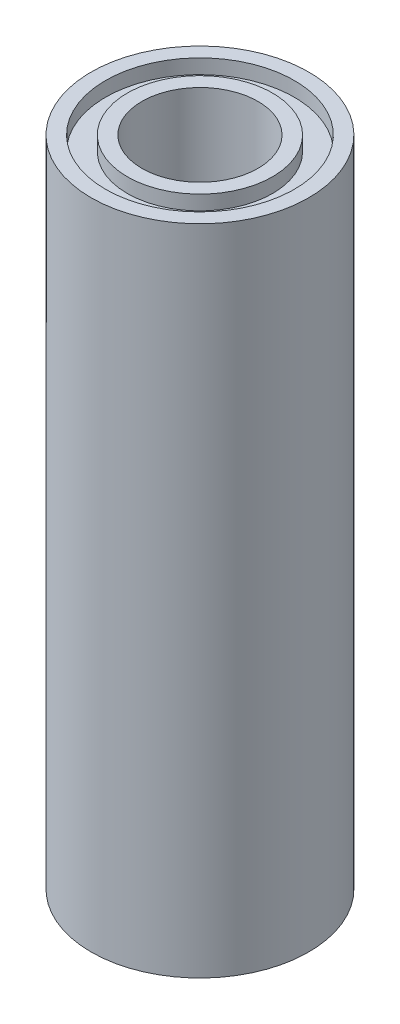
ISO-10303-21;
HEADER;
FILE_DESCRIPTION(('STEP AP214'),'2;1');
FILE_NAME('part.step','',(''),(''),'','','');
FILE_SCHEMA(('AUTOMOTIVE_DESIGN { 1 0 10303 214 1 1 1 1 }'));
ENDSEC;
DATA;
#1=APPLICATION_CONTEXT('core data for automotive mechanical design processes');
#2=APPLICATION_PROTOCOL_DEFINITION('international standard','automotive_design',2000,#1);
#3=PRODUCT_CONTEXT('',#1,'mechanical');
#4=PRODUCT('Part','Part','',(#3));
#5=PRODUCT_RELATED_PRODUCT_CATEGORY('part','',(#4));
#6=PRODUCT_DEFINITION_FORMATION('','',#4);
#7=PRODUCT_DEFINITION_CONTEXT('part definition',#1,'design');
#8=PRODUCT_DEFINITION('design','',#6,#7);
#9=PRODUCT_DEFINITION_SHAPE('','',#8);
#10=(LENGTH_UNIT() NAMED_UNIT(*) SI_UNIT(.MILLI.,.METRE.));
#11=(NAMED_UNIT(*) PLANE_ANGLE_UNIT() SI_UNIT($,.RADIAN.));
#12=(NAMED_UNIT(*) SI_UNIT($,.STERADIAN.) SOLID_ANGLE_UNIT());
#13=UNCERTAINTY_MEASURE_WITH_UNIT(LENGTH_MEASURE(1.E-05),#10,'distance_accuracy_value','');
#14=(GEOMETRIC_REPRESENTATION_CONTEXT(3) GLOBAL_UNCERTAINTY_ASSIGNED_CONTEXT((#13)) GLOBAL_UNIT_ASSIGNED_CONTEXT((#10,
#11,#12)) REPRESENTATION_CONTEXT('',''));
#15=CARTESIAN_POINT('',(0.,0.,0.));
#16=DIRECTION('',(0.,0.,1.));
#17=DIRECTION('',(1.,0.,0.));
#18=AXIS2_PLACEMENT_3D('',#15,#16,#17);
#19=CARTESIAN_POINT('',(0.,45.,0.));
#20=DIRECTION('',(0.,1.,0.));
#21=DIRECTION('',(0.,0.,1.));
#22=AXIS2_PLACEMENT_3D('',#19,#20,#21);
#23=PLANE('',#22);
#24=CARTESIAN_POINT('',(0.,45.,0.));
#25=DIRECTION('',(0.,1.,0.));
#26=DIRECTION('',(0.,0.,1.));
#27=AXIS2_PLACEMENT_3D('',#24,#25,#26);
#28=CIRCLE('',#27,4.);
#29=CARTESIAN_POINT('',(0.,45.,4.));
#30=VERTEX_POINT('',#29);
#31=EDGE_CURVE('E44',#30,#30,#28,.T.);
#32=ORIENTED_EDGE('',*,*,#31,.F.);
#33=EDGE_LOOP('',(#32));
#34=FACE_BOUND('',#33,.T.);
#35=CARTESIAN_POINT('',(0.,45.,0.));
#36=DIRECTION('',(0.,1.,0.));
#37=DIRECTION('',(0.,0.,1.));
#38=AXIS2_PLACEMENT_3D('',#35,#36,#37);
#39=CIRCLE('',#38,5.);
#40=CARTESIAN_POINT('',(0.,45.,5.));
#41=VERTEX_POINT('',#40);
#42=EDGE_CURVE('E58',#41,#41,#39,.T.);
#43=ORIENTED_EDGE('',*,*,#42,.T.);
#44=EDGE_LOOP('',(#43));
#45=FACE_BOUND('',#44,.T.);
#46=ADVANCED_FACE('F33',(#34,#45),#23,.T.);
#47=CARTESIAN_POINT('',(0.,45.,0.));
#48=DIRECTION('',(0.,1.,0.));
#49=DIRECTION('',(0.,0.,1.));
#50=AXIS2_PLACEMENT_3D('',#47,#48,#49);
#51=CIRCLE('',#50,6.5);
#52=CARTESIAN_POINT('',(0.,45.,6.5));
#53=VERTEX_POINT('',#52);
#54=EDGE_CURVE('E52',#53,#53,#51,.T.);
#55=ORIENTED_EDGE('',*,*,#54,.F.);
#56=EDGE_LOOP('',(#55));
#57=FACE_BOUND('',#56,.T.);
#58=CARTESIAN_POINT('',(0.,45.,0.));
#59=DIRECTION('',(0.,1.,0.));
#60=DIRECTION('',(0.,0.,1.));
#61=AXIS2_PLACEMENT_3D('',#58,#59,#60);
#62=CIRCLE('',#61,7.5);
#63=CARTESIAN_POINT('',(0.,45.,7.5));
#64=VERTEX_POINT('',#63);
#65=EDGE_CURVE('E10',#64,#64,#62,.T.);
#66=ORIENTED_EDGE('',*,*,#65,.T.);
#67=EDGE_LOOP('',(#66));
#68=FACE_BOUND('',#67,.T.);
#69=ADVANCED_FACE('F80',(#57,#68),#23,.T.);
#70=CARTESIAN_POINT('',(0.,0.,0.));
#71=DIRECTION('',(0.,1.,0.));
#72=DIRECTION('',(0.,0.,1.));
#73=AXIS2_PLACEMENT_3D('',#70,#71,#72);
#74=PLANE('',#73);
#75=CARTESIAN_POINT('',(0.,0.,0.));
#76=DIRECTION('',(0.,1.,0.));
#77=DIRECTION('',(0.,0.,1.));
#78=AXIS2_PLACEMENT_3D('',#75,#76,#77);
#79=CIRCLE('',#78,7.5);
#80=CARTESIAN_POINT('',(0.,0.,7.5));
#81=VERTEX_POINT('',#80);
#82=EDGE_CURVE('E37',#81,#81,#79,.T.);
#83=ORIENTED_EDGE('',*,*,#82,.F.);
#84=EDGE_LOOP('',(#83));
#85=FACE_BOUND('',#84,.T.);
#86=CARTESIAN_POINT('',(0.,0.,0.));
#87=DIRECTION('',(0.,1.,0.));
#88=DIRECTION('',(0.,0.,1.));
#89=AXIS2_PLACEMENT_3D('',#86,#87,#88);
#90=CIRCLE('',#89,4.);
#91=CARTESIAN_POINT('',(0.,0.,4.));
#92=VERTEX_POINT('',#91);
#93=EDGE_CURVE('E46',#92,#92,#90,.T.);
#94=ORIENTED_EDGE('',*,*,#93,.T.);
#95=EDGE_LOOP('',(#94));
#96=FACE_BOUND('',#95,.T.);
#97=ADVANCED_FACE('F82',(#85,#96),#74,.F.);
#98=CARTESIAN_POINT('',(0.,45.,0.));
#99=DIRECTION('',(0.,-1.,0.));
#100=DIRECTION('',(0.,0.,-1.));
#101=AXIS2_PLACEMENT_3D('',#98,#99,#100);
#102=CYLINDRICAL_SURFACE('',#101,7.5);
#103=ORIENTED_EDGE('',*,*,#65,.F.);
#104=EDGE_LOOP('',(#103));
#105=FACE_BOUND('',#104,.T.);
#106=ORIENTED_EDGE('',*,*,#82,.T.);
#107=EDGE_LOOP('',(#106));
#108=FACE_BOUND('',#107,.T.);
#109=ADVANCED_FACE('F35',(#105,#108),#102,.T.);
#110=CARTESIAN_POINT('',(0.,45.,0.));
#111=DIRECTION('',(0.,-1.,0.));
#112=DIRECTION('',(0.,0.,-1.));
#113=AXIS2_PLACEMENT_3D('',#110,#111,#112);
#114=CYLINDRICAL_SURFACE('',#113,4.);
#115=ORIENTED_EDGE('',*,*,#31,.T.);
#116=EDGE_LOOP('',(#115));
#117=FACE_BOUND('',#116,.T.);
#118=ORIENTED_EDGE('',*,*,#93,.F.);
#119=EDGE_LOOP('',(#118));
#120=FACE_BOUND('',#119,.T.);
#121=ADVANCED_FACE('F76',(#117,#120),#114,.F.);
#122=CARTESIAN_POINT('',(0.,44.,0.));
#123=DIRECTION('',(0.,1.,0.));
#124=DIRECTION('',(0.,0.,1.));
#125=AXIS2_PLACEMENT_3D('',#122,#123,#124);
#126=CYLINDRICAL_SURFACE('',#125,6.5);
#127=CARTESIAN_POINT('',(0.,44.,0.));
#128=DIRECTION('',(0.,1.,0.));
#129=DIRECTION('',(0.,0.,1.));
#130=AXIS2_PLACEMENT_3D('',#127,#128,#129);
#131=CIRCLE('',#130,6.5);
#132=CARTESIAN_POINT('',(0.,44.,6.5));
#133=VERTEX_POINT('',#132);
#134=EDGE_CURVE('E49',#133,#133,#131,.T.);
#135=ORIENTED_EDGE('',*,*,#134,.F.);
#136=EDGE_LOOP('',(#135));
#137=FACE_BOUND('',#136,.T.);
#138=ORIENTED_EDGE('',*,*,#54,.T.);
#139=EDGE_LOOP('',(#138));
#140=FACE_BOUND('',#139,.T.);
#141=ADVANCED_FACE('F70',(#137,#140),#126,.F.);
#142=CARTESIAN_POINT('',(0.,44.,0.));
#143=DIRECTION('',(0.,1.,0.));
#144=DIRECTION('',(0.,0.,1.));
#145=AXIS2_PLACEMENT_3D('',#142,#143,#144);
#146=PLANE('',#145);
#147=CARTESIAN_POINT('',(0.,44.,0.));
#148=DIRECTION('',(0.,1.,0.));
#149=DIRECTION('',(0.,0.,1.));
#150=AXIS2_PLACEMENT_3D('',#147,#148,#149);
#151=CIRCLE('',#150,5.);
#152=CARTESIAN_POINT('',(0.,44.,5.));
#153=VERTEX_POINT('',#152);
#154=EDGE_CURVE('E55',#153,#153,#151,.T.);
#155=ORIENTED_EDGE('',*,*,#154,.F.);
#156=EDGE_LOOP('',(#155));
#157=FACE_BOUND('',#156,.T.);
#158=ORIENTED_EDGE('',*,*,#134,.T.);
#159=EDGE_LOOP('',(#158));
#160=FACE_BOUND('',#159,.T.);
#161=ADVANCED_FACE('F67',(#157,#160),#146,.T.);
#162=CARTESIAN_POINT('',(0.,44.,0.));
#163=DIRECTION('',(0.,1.,0.));
#164=DIRECTION('',(0.,0.,1.));
#165=AXIS2_PLACEMENT_3D('',#162,#163,#164);
#166=CYLINDRICAL_SURFACE('',#165,5.);
#167=ORIENTED_EDGE('',*,*,#154,.T.);
#168=EDGE_LOOP('',(#167));
#169=FACE_BOUND('',#168,.T.);
#170=ORIENTED_EDGE('',*,*,#42,.F.);
#171=EDGE_LOOP('',(#170));
#172=FACE_BOUND('',#171,.T.);
#173=ADVANCED_FACE('F64',(#169,#172),#166,.T.);
#174=CLOSED_SHELL('',(#46,#69,#97,#109,#121,#141,#161,#173));
#175=MANIFOLD_SOLID_BREP('B2',#174);
#176=ADVANCED_BREP_SHAPE_REPRESENTATION('',(#18,#175),#14);
#177=SHAPE_DEFINITION_REPRESENTATION(#9,#176);
ENDSEC;
END-ISO-10303-21;
